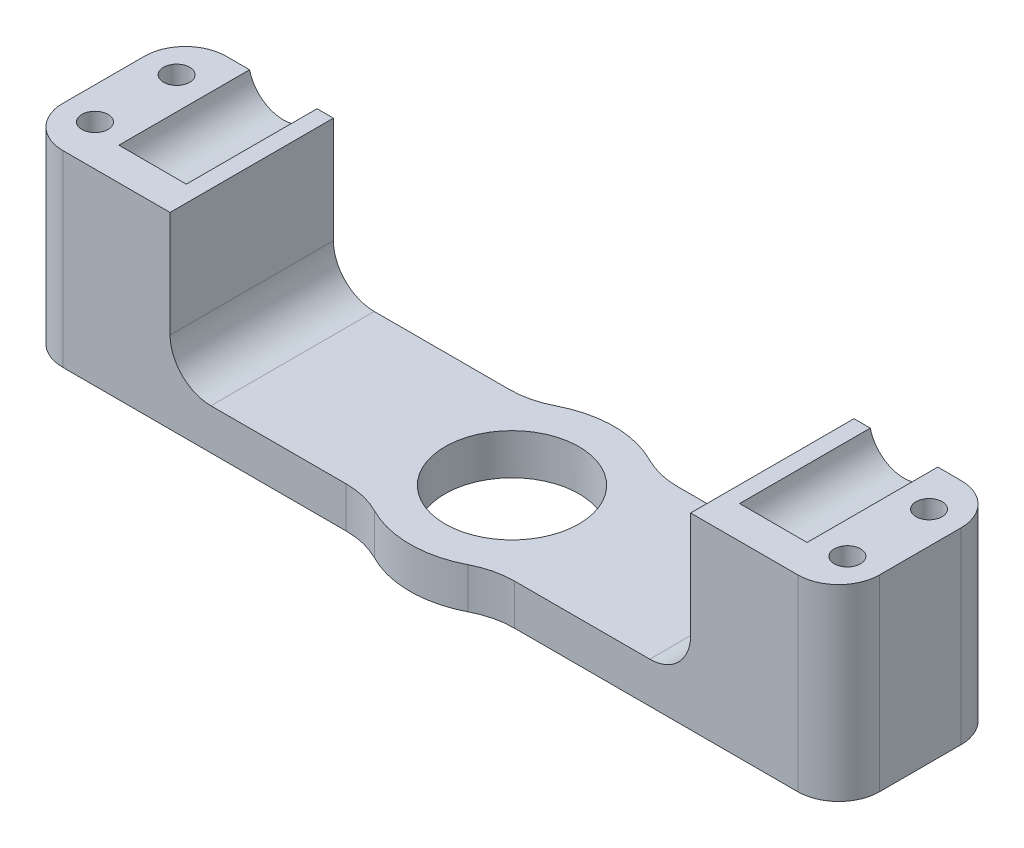
ISO-10303-21;
HEADER;
FILE_DESCRIPTION(('STEP AP214'),'2;1');
FILE_NAME('part.step','',(''),(''),'','','');
FILE_SCHEMA(('AUTOMOTIVE_DESIGN { 1 0 10303 214 1 1 1 1 }'));
ENDSEC;
DATA;
#1=APPLICATION_CONTEXT('core data for automotive mechanical design processes');
#2=APPLICATION_PROTOCOL_DEFINITION('international standard','automotive_design',2000,#1);
#3=PRODUCT_CONTEXT('',#1,'mechanical');
#4=PRODUCT('Part','Part','',(#3));
#5=PRODUCT_RELATED_PRODUCT_CATEGORY('part','',(#4));
#6=PRODUCT_DEFINITION_FORMATION('','',#4);
#7=PRODUCT_DEFINITION_CONTEXT('part definition',#1,'design');
#8=PRODUCT_DEFINITION('design','',#6,#7);
#9=PRODUCT_DEFINITION_SHAPE('','',#8);
#10=(LENGTH_UNIT() NAMED_UNIT(*) SI_UNIT(.MILLI.,.METRE.));
#11=(NAMED_UNIT(*) PLANE_ANGLE_UNIT() SI_UNIT($,.RADIAN.));
#12=(NAMED_UNIT(*) SI_UNIT($,.STERADIAN.) SOLID_ANGLE_UNIT());
#13=UNCERTAINTY_MEASURE_WITH_UNIT(LENGTH_MEASURE(1.E-05),#10,'distance_accuracy_value','');
#14=(GEOMETRIC_REPRESENTATION_CONTEXT(3) GLOBAL_UNCERTAINTY_ASSIGNED_CONTEXT((#13)) GLOBAL_UNIT_ASSIGNED_CONTEXT((#10,
#11,#12)) REPRESENTATION_CONTEXT('',''));
#15=CARTESIAN_POINT('',(0.,0.,0.));
#16=DIRECTION('',(0.,0.,1.));
#17=DIRECTION('',(1.,0.,0.));
#18=AXIS2_PLACEMENT_3D('',#15,#16,#17);
#19=CARTESIAN_POINT('',(-38.,24.,-10.));
#20=DIRECTION('',(0.,0.,1.));
#21=DIRECTION('',(1.,0.,0.));
#22=AXIS2_PLACEMENT_3D('',#19,#20,#21);
#23=CYLINDRICAL_SURFACE('',#22,4.25);
#24=CARTESIAN_POINT('',(-38.,24.,6.));
#25=DIRECTION('',(0.,0.,1.));
#26=DIRECTION('',(1.,0.,0.));
#27=AXIS2_PLACEMENT_3D('',#24,#25,#26);
#28=CIRCLE('',#27,4.25);
#29=CARTESIAN_POINT('',(-42.1306779104646,23.,6.));
#30=VERTEX_POINT('',#29);
#31=CARTESIAN_POINT('',(-33.8693220895354,23.,6.));
#32=VERTEX_POINT('',#31);
#33=EDGE_CURVE('E54',#30,#32,#28,.T.);
#34=ORIENTED_EDGE('',*,*,#33,.T.);
#35=DIRECTION('',(0.,0.,1.));
#36=VECTOR('',#35,1.);
#37=CARTESIAN_POINT('',(-33.8693220895354,23.,-10.));
#38=LINE('',#37,#36);
#39=CARTESIAN_POINT('',(-33.8693220895354,23.,-10.));
#40=VERTEX_POINT('',#39);
#41=EDGE_CURVE('E309',#32,#40,#38,.F.);
#42=ORIENTED_EDGE('',*,*,#41,.T.);
#43=CARTESIAN_POINT('',(-38.,24.,-10.));
#44=DIRECTION('',(0.,0.,1.));
#45=DIRECTION('',(1.,0.,0.));
#46=AXIS2_PLACEMENT_3D('',#43,#44,#45);
#47=CIRCLE('',#46,4.25);
#48=CARTESIAN_POINT('',(-42.1306779104646,23.,-10.));
#49=VERTEX_POINT('',#48);
#50=EDGE_CURVE('E328',#49,#40,#47,.T.);
#51=ORIENTED_EDGE('',*,*,#50,.F.);
#52=DIRECTION('',(0.,0.,1.));
#53=VECTOR('',#52,1.);
#54=CARTESIAN_POINT('',(-42.1306779104646,23.,-10.));
#55=LINE('',#54,#53);
#56=EDGE_CURVE('E59',#49,#30,#55,.T.);
#57=ORIENTED_EDGE('',*,*,#56,.T.);
#58=EDGE_LOOP('',(#34,#42,#51,#57));
#59=FACE_BOUND('',#58,.T.);
#60=ADVANCED_FACE('F39',(#59),#23,.F.);
#61=CARTESIAN_POINT('',(38.,24.,-10.));
#62=DIRECTION('',(0.,0.,1.));
#63=DIRECTION('',(1.,0.,0.));
#64=AXIS2_PLACEMENT_3D('',#61,#62,#63);
#65=CYLINDRICAL_SURFACE('',#64,4.25);
#66=CARTESIAN_POINT('',(38.,24.,6.));
#67=DIRECTION('',(0.,0.,1.));
#68=DIRECTION('',(1.,0.,0.));
#69=AXIS2_PLACEMENT_3D('',#66,#67,#68);
#70=CIRCLE('',#69,4.25);
#71=CARTESIAN_POINT('',(33.8693220895354,23.,6.));
#72=VERTEX_POINT('',#71);
#73=CARTESIAN_POINT('',(42.1306779104646,23.,6.));
#74=VERTEX_POINT('',#73);
#75=EDGE_CURVE('E224',#72,#74,#70,.T.);
#76=ORIENTED_EDGE('',*,*,#75,.T.);
#77=DIRECTION('',(0.,0.,1.));
#78=VECTOR('',#77,1.);
#79=CARTESIAN_POINT('',(42.1306779104646,23.,-10.));
#80=LINE('',#79,#78);
#81=CARTESIAN_POINT('',(42.1306779104646,23.,-10.));
#82=VERTEX_POINT('',#81);
#83=EDGE_CURVE('E210',#74,#82,#80,.F.);
#84=ORIENTED_EDGE('',*,*,#83,.T.);
#85=CARTESIAN_POINT('',(38.,24.,-10.));
#86=DIRECTION('',(0.,0.,1.));
#87=DIRECTION('',(-1.,0.,0.));
#88=AXIS2_PLACEMENT_3D('',#85,#86,#87);
#89=CIRCLE('',#88,4.25);
#90=CARTESIAN_POINT('',(33.8693220895354,23.,-10.));
#91=VERTEX_POINT('',#90);
#92=EDGE_CURVE('E332',#91,#82,#89,.T.);
#93=ORIENTED_EDGE('',*,*,#92,.F.);
#94=DIRECTION('',(0.,0.,1.));
#95=VECTOR('',#94,1.);
#96=CARTESIAN_POINT('',(33.8693220895354,23.,-10.));
#97=LINE('',#96,#95);
#98=EDGE_CURVE('E226',#91,#72,#97,.T.);
#99=ORIENTED_EDGE('',*,*,#98,.T.);
#100=EDGE_LOOP('',(#76,#84,#93,#99));
#101=FACE_BOUND('',#100,.T.);
#102=ADVANCED_FACE('F225',(#101),#65,.F.);
#103=CARTESIAN_POINT('',(-44.,48.,-10.));
#104=DIRECTION('',(0.,0.,1.));
#105=DIRECTION('',(1.,0.,0.));
#106=AXIS2_PLACEMENT_3D('',#103,#104,#105);
#107=PLANE('',#106);
#108=DIRECTION('',(1.,0.,0.));
#109=VECTOR('',#108,1.);
#110=CARTESIAN_POINT('',(-44.,23.,-10.));
#111=LINE('',#110,#109);
#112=CARTESIAN_POINT('',(45.,23.,-10.));
#113=VERTEX_POINT('',#112);
#114=EDGE_CURVE('E217',#82,#113,#111,.T.);
#115=ORIENTED_EDGE('',*,*,#114,.T.);
#116=DIRECTION('',(0.,1.,0.));
#117=VECTOR('',#116,1.);
#118=CARTESIAN_POINT('',(45.,0.,-10.));
#119=LINE('',#118,#117);
#120=CARTESIAN_POINT('',(45.,0.,-10.));
#121=VERTEX_POINT('',#120);
#122=EDGE_CURVE('E11',#113,#121,#119,.F.);
#123=ORIENTED_EDGE('',*,*,#122,.T.);
#124=DIRECTION('',(-1.,0.,0.));
#125=VECTOR('',#124,1.);
#126=CARTESIAN_POINT('',(-44.,0.,-10.));
#127=LINE('',#126,#125);
#128=CARTESIAN_POINT('',(10.3077640640441,0.,-10.));
#129=VERTEX_POINT('',#128);
#130=EDGE_CURVE('E334',#121,#129,#127,.T.);
#131=ORIENTED_EDGE('',*,*,#130,.T.);
#132=DIRECTION('',(0.,1.,0.));
#133=VECTOR('',#132,1.);
#134=CARTESIAN_POINT('',(10.3077640640441,48.,-10.));
#135=LINE('',#134,#133);
#136=CARTESIAN_POINT('',(10.3077640640441,5.,-10.));
#137=VERTEX_POINT('',#136);
#138=EDGE_CURVE('E349',#129,#137,#135,.T.);
#139=ORIENTED_EDGE('',*,*,#138,.T.);
#140=DIRECTION('',(1.,0.,0.));
#141=VECTOR('',#140,1.);
#142=CARTESIAN_POINT('',(-44.,4.99999999999999,-10.));
#143=LINE('',#142,#141);
#144=CARTESIAN_POINT('',(26.8693220895354,5.,-10.));
#145=VERTEX_POINT('',#144);
#146=EDGE_CURVE('E287',#137,#145,#143,.T.);
#147=ORIENTED_EDGE('',*,*,#146,.T.);
#148=CARTESIAN_POINT('',(26.8693220895354,10.,-10.));
#149=DIRECTION('',(0.,0.,1.));
#150=DIRECTION('',(1.,0.,0.));
#151=AXIS2_PLACEMENT_3D('',#148,#149,#150);
#152=CIRCLE('',#151,5.);
#153=CARTESIAN_POINT('',(31.8693220895354,9.99999999999999,-10.));
#154=VERTEX_POINT('',#153);
#155=EDGE_CURVE('E394',#145,#154,#152,.T.);
#156=ORIENTED_EDGE('',*,*,#155,.T.);
#157=DIRECTION('',(0.,1.,0.));
#158=VECTOR('',#157,1.);
#159=CARTESIAN_POINT('',(31.8693220895354,48.,-10.));
#160=LINE('',#159,#158);
#161=CARTESIAN_POINT('',(31.8693220895354,23.,-10.));
#162=VERTEX_POINT('',#161);
#163=EDGE_CURVE('E278',#154,#162,#160,.T.);
#164=ORIENTED_EDGE('',*,*,#163,.T.);
#165=EDGE_CURVE('E312',#162,#91,#111,.T.);
#166=ORIENTED_EDGE('',*,*,#165,.T.);
#167=ORIENTED_EDGE('',*,*,#92,.T.);
#168=EDGE_LOOP('',(#115,#123,#131,#139,#147,#156,#164,#166,#167));
#169=FACE_BOUND('',#168,.T.);
#170=ADVANCED_FACE('F510',(#169),#107,.F.);
#171=CARTESIAN_POINT('',(-44.,48.,10.));
#172=DIRECTION('',(0.,0.,-1.));
#173=DIRECTION('',(-1.,0.,0.));
#174=AXIS2_PLACEMENT_3D('',#171,#172,#173);
#175=PLANE('',#174);
#176=DIRECTION('',(-1.,0.,0.));
#177=VECTOR('',#176,1.);
#178=CARTESIAN_POINT('',(-44.,23.,10.));
#179=LINE('',#178,#177);
#180=CARTESIAN_POINT('',(-31.8693220895354,23.,10.));
#181=VERTEX_POINT('',#180);
#182=CARTESIAN_POINT('',(-45.,23.,10.));
#183=VERTEX_POINT('',#182);
#184=EDGE_CURVE('E221',#181,#183,#179,.T.);
#185=ORIENTED_EDGE('',*,*,#184,.T.);
#186=DIRECTION('',(0.,-1.,0.));
#187=VECTOR('',#186,1.);
#188=CARTESIAN_POINT('',(-45.,0.,10.));
#189=LINE('',#188,#187);
#190=CARTESIAN_POINT('',(-45.,0.,10.));
#191=VERTEX_POINT('',#190);
#192=EDGE_CURVE('E415',#183,#191,#189,.T.);
#193=ORIENTED_EDGE('',*,*,#192,.T.);
#194=DIRECTION('',(1.,0.,0.));
#195=VECTOR('',#194,1.);
#196=CARTESIAN_POINT('',(-44.,0.,10.));
#197=LINE('',#196,#195);
#198=CARTESIAN_POINT('',(-10.3077640640441,0.,10.));
#199=VERTEX_POINT('',#198);
#200=EDGE_CURVE('E337',#191,#199,#197,.T.);
#201=ORIENTED_EDGE('',*,*,#200,.T.);
#202=DIRECTION('',(0.,1.,0.));
#203=VECTOR('',#202,1.);
#204=CARTESIAN_POINT('',(-10.3077640640441,48.,10.));
#205=LINE('',#204,#203);
#206=CARTESIAN_POINT('',(-10.3077640640441,4.99999999999999,10.));
#207=VERTEX_POINT('',#206);
#208=EDGE_CURVE('E346',#199,#207,#205,.T.);
#209=ORIENTED_EDGE('',*,*,#208,.T.);
#210=DIRECTION('',(-1.,0.,0.));
#211=VECTOR('',#210,1.);
#212=CARTESIAN_POINT('',(-44.,4.99999999999999,10.));
#213=LINE('',#212,#211);
#214=CARTESIAN_POINT('',(-26.8693220895354,4.99999999999999,10.));
#215=VERTEX_POINT('',#214);
#216=EDGE_CURVE('E293',#207,#215,#213,.T.);
#217=ORIENTED_EDGE('',*,*,#216,.T.);
#218=CARTESIAN_POINT('',(-26.8693220895354,9.99999999999999,10.));
#219=DIRECTION('',(0.,0.,-1.));
#220=DIRECTION('',(-1.,0.,0.));
#221=AXIS2_PLACEMENT_3D('',#218,#219,#220);
#222=CIRCLE('',#221,5.);
#223=CARTESIAN_POINT('',(-31.8693220895354,9.99999999999999,10.));
#224=VERTEX_POINT('',#223);
#225=EDGE_CURVE('E388',#215,#224,#222,.T.);
#226=ORIENTED_EDGE('',*,*,#225,.T.);
#227=DIRECTION('',(0.,1.,0.));
#228=VECTOR('',#227,1.);
#229=CARTESIAN_POINT('',(-31.8693220895354,48.,10.));
#230=LINE('',#229,#228);
#231=EDGE_CURVE('E272',#224,#181,#230,.T.);
#232=ORIENTED_EDGE('',*,*,#231,.T.);
#233=EDGE_LOOP('',(#185,#193,#201,#209,#217,#226,#232));
#234=FACE_BOUND('',#233,.T.);
#235=ADVANCED_FACE('F464',(#234),#175,.F.);
#236=CARTESIAN_POINT('',(-10.3077640640441,0.,-10.));
#237=VERTEX_POINT('',#236);
#238=CARTESIAN_POINT('',(-45.,0.,-10.));
#239=VERTEX_POINT('',#238);
#240=EDGE_CURVE('E331',#237,#239,#127,.T.);
#241=ORIENTED_EDGE('',*,*,#240,.T.);
#242=DIRECTION('',(0.,1.,0.));
#243=VECTOR('',#242,1.);
#244=CARTESIAN_POINT('',(-45.,23.,-10.));
#245=LINE('',#244,#243);
#246=CARTESIAN_POINT('',(-45.,23.,-10.));
#247=VERTEX_POINT('',#246);
#248=EDGE_CURVE('E396',#239,#247,#245,.T.);
#249=ORIENTED_EDGE('',*,*,#248,.T.);
#250=DIRECTION('',(1.,0.,0.));
#251=VECTOR('',#250,1.);
#252=CARTESIAN_POINT('',(-44.,23.,-10.));
#253=LINE('',#252,#251);
#254=EDGE_CURVE('E310',#247,#49,#253,.T.);
#255=ORIENTED_EDGE('',*,*,#254,.T.);
#256=ORIENTED_EDGE('',*,*,#50,.T.);
#257=CARTESIAN_POINT('',(-31.8693220895354,23.,-10.));
#258=VERTEX_POINT('',#257);
#259=EDGE_CURVE('E306',#40,#258,#253,.T.);
#260=ORIENTED_EDGE('',*,*,#259,.T.);
#261=DIRECTION('',(0.,-1.,0.));
#262=VECTOR('',#261,1.);
#263=CARTESIAN_POINT('',(-31.8693220895354,48.,-10.));
#264=LINE('',#263,#262);
#265=CARTESIAN_POINT('',(-31.8693220895354,9.99999999999999,-10.));
#266=VERTEX_POINT('',#265);
#267=EDGE_CURVE('E269',#258,#266,#264,.T.);
#268=ORIENTED_EDGE('',*,*,#267,.T.);
#269=CARTESIAN_POINT('',(-26.8693220895354,9.99999999999999,-10.));
#270=DIRECTION('',(0.,0.,1.));
#271=DIRECTION('',(1.,0.,0.));
#272=AXIS2_PLACEMENT_3D('',#269,#270,#271);
#273=CIRCLE('',#272,5.);
#274=CARTESIAN_POINT('',(-26.8693220895354,4.99999999999999,-10.));
#275=VERTEX_POINT('',#274);
#276=EDGE_CURVE('E390',#266,#275,#273,.T.);
#277=ORIENTED_EDGE('',*,*,#276,.T.);
#278=DIRECTION('',(1.,0.,0.));
#279=VECTOR('',#278,1.);
#280=CARTESIAN_POINT('',(-44.,4.99999999999999,-10.));
#281=LINE('',#280,#279);
#282=CARTESIAN_POINT('',(-10.3077640640441,4.99999999999999,-10.));
#283=VERTEX_POINT('',#282);
#284=EDGE_CURVE('E280',#275,#283,#281,.T.);
#285=ORIENTED_EDGE('',*,*,#284,.T.);
#286=DIRECTION('',(0.,1.,0.));
#287=VECTOR('',#286,1.);
#288=CARTESIAN_POINT('',(-10.3077640640441,48.,-10.));
#289=LINE('',#288,#287);
#290=EDGE_CURVE('E357',#283,#237,#289,.F.);
#291=ORIENTED_EDGE('',*,*,#290,.T.);
#292=EDGE_LOOP('',(#241,#249,#255,#256,#260,#268,#277,#285,#291));
#293=FACE_BOUND('',#292,.T.);
#294=ADVANCED_FACE('F483',(#293),#107,.F.);
#295=CARTESIAN_POINT('',(10.3077640640441,0.,10.));
#296=VERTEX_POINT('',#295);
#297=CARTESIAN_POINT('',(45.,0.,10.));
#298=VERTEX_POINT('',#297);
#299=EDGE_CURVE('E336',#296,#298,#197,.T.);
#300=ORIENTED_EDGE('',*,*,#299,.T.);
#301=DIRECTION('',(0.,-1.,0.));
#302=VECTOR('',#301,1.);
#303=CARTESIAN_POINT('',(45.,23.,10.));
#304=LINE('',#303,#302);
#305=CARTESIAN_POINT('',(45.,23.,10.));
#306=VERTEX_POINT('',#305);
#307=EDGE_CURVE('E424',#298,#306,#304,.F.);
#308=ORIENTED_EDGE('',*,*,#307,.T.);
#309=DIRECTION('',(-1.,0.,0.));
#310=VECTOR('',#309,1.);
#311=CARTESIAN_POINT('',(-44.,23.,10.));
#312=LINE('',#311,#310);
#313=CARTESIAN_POINT('',(31.8693220895354,23.,10.));
#314=VERTEX_POINT('',#313);
#315=EDGE_CURVE('E317',#306,#314,#312,.T.);
#316=ORIENTED_EDGE('',*,*,#315,.T.);
#317=DIRECTION('',(0.,-1.,0.));
#318=VECTOR('',#317,1.);
#319=CARTESIAN_POINT('',(31.8693220895354,48.,10.));
#320=LINE('',#319,#318);
#321=CARTESIAN_POINT('',(31.8693220895354,9.99999999999999,10.));
#322=VERTEX_POINT('',#321);
#323=EDGE_CURVE('E275',#314,#322,#320,.T.);
#324=ORIENTED_EDGE('',*,*,#323,.T.);
#325=CARTESIAN_POINT('',(26.8693220895354,10.,10.));
#326=DIRECTION('',(0.,0.,-1.));
#327=DIRECTION('',(-1.,0.,0.));
#328=AXIS2_PLACEMENT_3D('',#325,#326,#327);
#329=CIRCLE('',#328,5.);
#330=CARTESIAN_POINT('',(26.8693220895354,5.,10.));
#331=VERTEX_POINT('',#330);
#332=EDGE_CURVE('E392',#322,#331,#329,.T.);
#333=ORIENTED_EDGE('',*,*,#332,.T.);
#334=DIRECTION('',(-1.,0.,0.));
#335=VECTOR('',#334,1.);
#336=CARTESIAN_POINT('',(-44.,4.99999999999999,10.));
#337=LINE('',#336,#335);
#338=CARTESIAN_POINT('',(10.3077640640441,5.,10.));
#339=VERTEX_POINT('',#338);
#340=EDGE_CURVE('E301',#331,#339,#337,.T.);
#341=ORIENTED_EDGE('',*,*,#340,.T.);
#342=DIRECTION('',(0.,1.,0.));
#343=VECTOR('',#342,1.);
#344=CARTESIAN_POINT('',(10.3077640640441,48.,10.));
#345=LINE('',#344,#343);
#346=EDGE_CURVE('E339',#339,#296,#345,.F.);
#347=ORIENTED_EDGE('',*,*,#346,.T.);
#348=EDGE_LOOP('',(#300,#308,#316,#324,#333,#341,#347));
#349=FACE_BOUND('',#348,.T.);
#350=ADVANCED_FACE('F443',(#349),#175,.F.);
#351=CARTESIAN_POINT('',(0.,0.,0.));
#352=DIRECTION('',(0.,-1.,0.));
#353=DIRECTION('',(0.,0.,-1.));
#354=AXIS2_PLACEMENT_3D('',#351,#352,#353);
#355=PLANE('',#354);
#356=CARTESIAN_POINT('',(-46.0653389552323,0.,-5.));
#357=DIRECTION('',(0.,-1.,0.));
#358=DIRECTION('',(0.,0.,1.));
#359=AXIS2_PLACEMENT_3D('',#356,#357,#358);
#360=CIRCLE('',#359,1.6);
#361=CARTESIAN_POINT('',(-46.0653389552323,0.,-3.4));
#362=VERTEX_POINT('',#361);
#363=EDGE_CURVE('E237',#362,#362,#360,.T.);
#364=ORIENTED_EDGE('',*,*,#363,.F.);
#365=EDGE_LOOP('',(#364));
#366=FACE_BOUND('',#365,.T.);
#367=CARTESIAN_POINT('',(-46.0653389552323,0.,5.));
#368=DIRECTION('',(0.,-1.,0.));
#369=DIRECTION('',(0.,0.,1.));
#370=AXIS2_PLACEMENT_3D('',#367,#368,#369);
#371=CIRCLE('',#370,1.6);
#372=CARTESIAN_POINT('',(-46.0653389552323,0.,6.6));
#373=VERTEX_POINT('',#372);
#374=EDGE_CURVE('E233',#373,#373,#371,.T.);
#375=ORIENTED_EDGE('',*,*,#374,.F.);
#376=EDGE_LOOP('',(#375));
#377=FACE_BOUND('',#376,.T.);
#378=CARTESIAN_POINT('',(46.0653389552323,0.,-5.));
#379=DIRECTION('',(0.,1.,0.));
#380=DIRECTION('',(0.,0.,1.));
#381=AXIS2_PLACEMENT_3D('',#378,#379,#380);
#382=CIRCLE('',#381,1.6);
#383=CARTESIAN_POINT('',(46.0653389552323,0.,-3.4));
#384=VERTEX_POINT('',#383);
#385=EDGE_CURVE('E252',#384,#384,#382,.T.);
#386=ORIENTED_EDGE('',*,*,#385,.T.);
#387=EDGE_LOOP('',(#386));
#388=FACE_BOUND('',#387,.T.);
#389=CARTESIAN_POINT('',(46.0653389552323,0.,5.));
#390=DIRECTION('',(0.,1.,0.));
#391=DIRECTION('',(0.,0.,1.));
#392=AXIS2_PLACEMENT_3D('',#389,#390,#391);
#393=CIRCLE('',#392,1.6);
#394=CARTESIAN_POINT('',(46.0653389552323,0.,6.6));
#395=VERTEX_POINT('',#394);
#396=EDGE_CURVE('E251',#395,#395,#393,.T.);
#397=ORIENTED_EDGE('',*,*,#396,.T.);
#398=EDGE_LOOP('',(#397));
#399=FACE_BOUND('',#398,.T.);
#400=CARTESIAN_POINT('',(0.,0.,0.));
#401=DIRECTION('',(0.,1.,0.));
#402=DIRECTION('',(0.,0.,1.));
#403=AXIS2_PLACEMENT_3D('',#400,#401,#402);
#404=CIRCLE('',#403,8.2);
#405=CARTESIAN_POINT('',(0.,0.,8.2));
#406=VERTEX_POINT('',#405);
#407=EDGE_CURVE('E321',#406,#406,#404,.T.);
#408=ORIENTED_EDGE('',*,*,#407,.T.);
#409=EDGE_LOOP('',(#408));
#410=FACE_BOUND('',#409,.T.);
#411=DIRECTION('',(0.,0.,-1.));
#412=VECTOR('',#411,1.);
#413=CARTESIAN_POINT('',(-50.,0.,10.));
#414=LINE('',#413,#412);
#415=CARTESIAN_POINT('',(-50.,0.,5.));
#416=VERTEX_POINT('',#415);
#417=CARTESIAN_POINT('',(-50.,0.,-5.));
#418=VERTEX_POINT('',#417);
#419=EDGE_CURVE('E240',#416,#418,#414,.T.);
#420=ORIENTED_EDGE('',*,*,#419,.T.);
#421=CARTESIAN_POINT('',(-45.,0.,-5.));
#422=DIRECTION('',(0.,-1.,0.));
#423=DIRECTION('',(0.,0.,-1.));
#424=AXIS2_PLACEMENT_3D('',#421,#422,#423);
#425=CIRCLE('',#424,5.);
#426=EDGE_CURVE('E413',#418,#239,#425,.T.);
#427=ORIENTED_EDGE('',*,*,#426,.T.);
#428=ORIENTED_EDGE('',*,*,#240,.F.);
#429=CARTESIAN_POINT('',(-10.3077640640441,0.,-20.));
#430=DIRECTION('',(0.,-1.,0.));
#431=DIRECTION('',(0.,0.,-1.));
#432=AXIS2_PLACEMENT_3D('',#429,#430,#431);
#433=CIRCLE('',#432,10.);
#434=CARTESIAN_POINT('',(-5.72653559113563,0.,-11.1111111111111));
#435=VERTEX_POINT('',#434);
#436=EDGE_CURVE('E367',#237,#435,#433,.F.);
#437=ORIENTED_EDGE('',*,*,#436,.T.);
#438=CARTESIAN_POINT('',(0.,0.,0.));
#439=DIRECTION('',(0.,-1.,0.));
#440=DIRECTION('',(0.,0.,-1.));
#441=AXIS2_PLACEMENT_3D('',#438,#439,#440);
#442=CIRCLE('',#441,12.5);
#443=CARTESIAN_POINT('',(5.72653559113563,0.,-11.1111111111111));
#444=VERTEX_POINT('',#443);
#445=EDGE_CURVE('E324',#444,#435,#442,.F.);
#446=ORIENTED_EDGE('',*,*,#445,.F.);
#447=CARTESIAN_POINT('',(10.3077640640441,0.,-20.));
#448=DIRECTION('',(0.,-1.,0.));
#449=DIRECTION('',(0.,0.,-1.));
#450=AXIS2_PLACEMENT_3D('',#447,#448,#449);
#451=CIRCLE('',#450,10.);
#452=EDGE_CURVE('E364',#444,#129,#451,.F.);
#453=ORIENTED_EDGE('',*,*,#452,.T.);
#454=ORIENTED_EDGE('',*,*,#130,.F.);
#455=CARTESIAN_POINT('',(45.,0.,-5.));
#456=DIRECTION('',(0.,-1.,0.));
#457=DIRECTION('',(0.,0.,-1.));
#458=AXIS2_PLACEMENT_3D('',#455,#456,#457);
#459=CIRCLE('',#458,5.);
#460=CARTESIAN_POINT('',(50.,0.,-5.));
#461=VERTEX_POINT('',#460);
#462=EDGE_CURVE('E407',#121,#461,#459,.T.);
#463=ORIENTED_EDGE('',*,*,#462,.T.);
#464=DIRECTION('',(0.,0.,-1.));
#465=VECTOR('',#464,1.);
#466=CARTESIAN_POINT('',(50.,0.,10.));
#467=LINE('',#466,#465);
#468=CARTESIAN_POINT('',(50.,0.,5.));
#469=VERTEX_POINT('',#468);
#470=EDGE_CURVE('E255',#469,#461,#467,.T.);
#471=ORIENTED_EDGE('',*,*,#470,.F.);
#472=CARTESIAN_POINT('',(45.,0.,5.));
#473=DIRECTION('',(0.,-1.,0.));
#474=DIRECTION('',(0.,0.,-1.));
#475=AXIS2_PLACEMENT_3D('',#472,#473,#474);
#476=CIRCLE('',#475,5.);
#477=EDGE_CURVE('E409',#469,#298,#476,.T.);
#478=ORIENTED_EDGE('',*,*,#477,.T.);
#479=ORIENTED_EDGE('',*,*,#299,.F.);
#480=CARTESIAN_POINT('',(10.3077640640441,0.,20.));
#481=DIRECTION('',(0.,-1.,0.));
#482=DIRECTION('',(0.,0.,-1.));
#483=AXIS2_PLACEMENT_3D('',#480,#481,#482);
#484=CIRCLE('',#483,10.);
#485=CARTESIAN_POINT('',(5.72653559113563,0.,11.1111111111111));
#486=VERTEX_POINT('',#485);
#487=EDGE_CURVE('E359',#296,#486,#484,.F.);
#488=ORIENTED_EDGE('',*,*,#487,.T.);
#489=CARTESIAN_POINT('',(-5.72653559113563,0.,11.1111111111111));
#490=VERTEX_POINT('',#489);
#491=EDGE_CURVE('E327',#490,#486,#442,.F.);
#492=ORIENTED_EDGE('',*,*,#491,.F.);
#493=CARTESIAN_POINT('',(-10.3077640640441,0.,20.));
#494=DIRECTION('',(0.,-1.,0.));
#495=DIRECTION('',(0.,0.,-1.));
#496=AXIS2_PLACEMENT_3D('',#493,#494,#495);
#497=CIRCLE('',#496,10.);
#498=EDGE_CURVE('E361',#490,#199,#497,.F.);
#499=ORIENTED_EDGE('',*,*,#498,.T.);
#500=ORIENTED_EDGE('',*,*,#200,.F.);
#501=CARTESIAN_POINT('',(-45.,0.,5.));
#502=DIRECTION('',(0.,-1.,0.));
#503=DIRECTION('',(0.,0.,-1.));
#504=AXIS2_PLACEMENT_3D('',#501,#502,#503);
#505=CIRCLE('',#504,5.);
#506=EDGE_CURVE('E411',#191,#416,#505,.T.);
#507=ORIENTED_EDGE('',*,*,#506,.T.);
#508=EDGE_LOOP('',(#420,#427,#428,#437,#446,#453,#454,#463,#471,#478,#479,#488,#492,#499,#500,#507));
#509=FACE_BOUND('',#508,.T.);
#510=ADVANCED_FACE('F441',(#366,#377,#388,#399,#410,#509),#355,.T.);
#511=CARTESIAN_POINT('',(0.,-35.3553390593274,0.));
#512=DIRECTION('',(0.,1.,0.));
#513=DIRECTION('',(0.,0.,1.));
#514=AXIS2_PLACEMENT_3D('',#511,#512,#513);
#515=CYLINDRICAL_SURFACE('',#514,12.5);
#516=CARTESIAN_POINT('',(0.,5.,0.));
#517=DIRECTION('',(0.,-1.,0.));
#518=DIRECTION('',(1.,0.,0.));
#519=AXIS2_PLACEMENT_3D('',#516,#517,#518);
#520=CIRCLE('',#519,12.5);
#521=CARTESIAN_POINT('',(-5.72653559113563,4.99999999999999,11.1111111111111));
#522=VERTEX_POINT('',#521);
#523=CARTESIAN_POINT('',(5.72653559113563,5.,11.1111111111111));
#524=VERTEX_POINT('',#523);
#525=EDGE_CURVE('E294',#522,#524,#520,.F.);
#526=ORIENTED_EDGE('',*,*,#525,.F.);
#527=DIRECTION('',(0.,1.,0.));
#528=VECTOR('',#527,1.);
#529=CARTESIAN_POINT('',(-5.72653559113563,-35.3553390593274,11.1111111111111));
#530=LINE('',#529,#528);
#531=EDGE_CURVE('E341',#522,#490,#530,.F.);
#532=ORIENTED_EDGE('',*,*,#531,.T.);
#533=ORIENTED_EDGE('',*,*,#491,.T.);
#534=DIRECTION('',(0.,1.,0.));
#535=VECTOR('',#534,1.);
#536=CARTESIAN_POINT('',(5.72653559113563,-35.3553390593274,11.1111111111111));
#537=LINE('',#536,#535);
#538=EDGE_CURVE('E343',#486,#524,#537,.T.);
#539=ORIENTED_EDGE('',*,*,#538,.T.);
#540=EDGE_LOOP('',(#526,#532,#533,#539));
#541=FACE_BOUND('',#540,.T.);
#542=ADVANCED_FACE('F455',(#541),#515,.T.);
#543=DIRECTION('',(0.,1.,0.));
#544=VECTOR('',#543,1.);
#545=CARTESIAN_POINT('',(-5.72653559113563,-35.3553390593274,-11.1111111111111));
#546=LINE('',#545,#544);
#547=CARTESIAN_POINT('',(-5.72653559113563,4.99999999999999,-11.1111111111111));
#548=VERTEX_POINT('',#547);
#549=EDGE_CURVE('E352',#435,#548,#546,.T.);
#550=ORIENTED_EDGE('',*,*,#549,.T.);
#551=CARTESIAN_POINT('',(0.,5.,0.));
#552=DIRECTION('',(0.,-1.,0.));
#553=DIRECTION('',(1.,0.,0.));
#554=AXIS2_PLACEMENT_3D('',#551,#552,#553);
#555=CIRCLE('',#554,12.5);
#556=CARTESIAN_POINT('',(5.72653559113563,5.,-11.1111111111111));
#557=VERTEX_POINT('',#556);
#558=EDGE_CURVE('E281',#557,#548,#555,.F.);
#559=ORIENTED_EDGE('',*,*,#558,.F.);
#560=DIRECTION('',(0.,1.,0.));
#561=VECTOR('',#560,1.);
#562=CARTESIAN_POINT('',(5.72653559113563,-35.3553390593274,-11.1111111111111));
#563=LINE('',#562,#561);
#564=EDGE_CURVE('E355',#557,#444,#563,.F.);
#565=ORIENTED_EDGE('',*,*,#564,.T.);
#566=ORIENTED_EDGE('',*,*,#445,.T.);
#567=EDGE_LOOP('',(#550,#559,#565,#566));
#568=FACE_BOUND('',#567,.T.);
#569=ADVANCED_FACE('F492',(#568),#515,.T.);
#570=CARTESIAN_POINT('',(0.,0.,0.));
#571=DIRECTION('',(0.,1.,0.));
#572=DIRECTION('',(0.,0.,1.));
#573=AXIS2_PLACEMENT_3D('',#570,#571,#572);
#574=CYLINDRICAL_SURFACE('',#573,8.2);
#575=CARTESIAN_POINT('',(0.,5.,0.));
#576=DIRECTION('',(0.,-1.,0.));
#577=DIRECTION('',(1.,0.,0.));
#578=AXIS2_PLACEMENT_3D('',#575,#576,#577);
#579=CIRCLE('',#578,8.2);
#580=CARTESIAN_POINT('',(8.2,5.,0.));
#581=VERTEX_POINT('',#580);
#582=EDGE_CURVE('E303',#581,#581,#579,.F.);
#583=ORIENTED_EDGE('',*,*,#582,.T.);
#584=EDGE_LOOP('',(#583));
#585=FACE_BOUND('',#584,.T.);
#586=ORIENTED_EDGE('',*,*,#407,.F.);
#587=EDGE_LOOP('',(#586));
#588=FACE_BOUND('',#587,.T.);
#589=ADVANCED_FACE('F550',(#585,#588),#574,.F.);
#590=CARTESIAN_POINT('',(10.3077640640441,-35.3553390593274,20.));
#591=DIRECTION('',(0.,1.,0.));
#592=DIRECTION('',(0.,0.,1.));
#593=AXIS2_PLACEMENT_3D('',#590,#591,#592);
#594=CYLINDRICAL_SURFACE('',#593,10.);
#595=ORIENTED_EDGE('',*,*,#346,.F.);
#596=CARTESIAN_POINT('',(10.3077640640441,5.,20.));
#597=DIRECTION('',(0.,-1.,0.));
#598=DIRECTION('',(1.,0.,0.));
#599=AXIS2_PLACEMENT_3D('',#596,#597,#598);
#600=CIRCLE('',#599,10.);
#601=EDGE_CURVE('E296',#339,#524,#600,.F.);
#602=ORIENTED_EDGE('',*,*,#601,.T.);
#603=ORIENTED_EDGE('',*,*,#538,.F.);
#604=ORIENTED_EDGE('',*,*,#487,.F.);
#605=EDGE_LOOP('',(#595,#602,#603,#604));
#606=FACE_BOUND('',#605,.T.);
#607=ADVANCED_FACE('F450',(#606),#594,.F.);
#608=CARTESIAN_POINT('',(-10.3077640640441,-35.3553390593274,20.));
#609=DIRECTION('',(0.,1.,0.));
#610=DIRECTION('',(0.,0.,1.));
#611=AXIS2_PLACEMENT_3D('',#608,#609,#610);
#612=CYLINDRICAL_SURFACE('',#611,10.);
#613=ORIENTED_EDGE('',*,*,#531,.F.);
#614=CARTESIAN_POINT('',(-10.3077640640441,4.99999999999999,20.));
#615=DIRECTION('',(0.,-1.,0.));
#616=DIRECTION('',(1.,0.,0.));
#617=AXIS2_PLACEMENT_3D('',#614,#615,#616);
#618=CIRCLE('',#617,10.);
#619=EDGE_CURVE('E290',#522,#207,#618,.F.);
#620=ORIENTED_EDGE('',*,*,#619,.T.);
#621=ORIENTED_EDGE('',*,*,#208,.F.);
#622=ORIENTED_EDGE('',*,*,#498,.F.);
#623=EDGE_LOOP('',(#613,#620,#621,#622));
#624=FACE_BOUND('',#623,.T.);
#625=ADVANCED_FACE('F459',(#624),#612,.F.);
#626=CARTESIAN_POINT('',(10.3077640640441,-35.3553390593274,-20.));
#627=DIRECTION('',(0.,1.,0.));
#628=DIRECTION('',(0.,0.,1.));
#629=AXIS2_PLACEMENT_3D('',#626,#627,#628);
#630=CYLINDRICAL_SURFACE('',#629,10.);
#631=ORIENTED_EDGE('',*,*,#564,.F.);
#632=CARTESIAN_POINT('',(10.3077640640441,5.,-20.));
#633=DIRECTION('',(0.,-1.,0.));
#634=DIRECTION('',(1.,0.,0.));
#635=AXIS2_PLACEMENT_3D('',#632,#633,#634);
#636=CIRCLE('',#635,10.);
#637=EDGE_CURVE('E283',#557,#137,#636,.F.);
#638=ORIENTED_EDGE('',*,*,#637,.T.);
#639=ORIENTED_EDGE('',*,*,#138,.F.);
#640=ORIENTED_EDGE('',*,*,#452,.F.);
#641=EDGE_LOOP('',(#631,#638,#639,#640));
#642=FACE_BOUND('',#641,.T.);
#643=ADVANCED_FACE('F503',(#642),#630,.F.);
#644=CARTESIAN_POINT('',(-10.3077640640441,-35.3553390593274,-20.));
#645=DIRECTION('',(0.,1.,0.));
#646=DIRECTION('',(0.,0.,1.));
#647=AXIS2_PLACEMENT_3D('',#644,#645,#646);
#648=CYLINDRICAL_SURFACE('',#647,10.);
#649=ORIENTED_EDGE('',*,*,#290,.F.);
#650=CARTESIAN_POINT('',(-10.3077640640441,4.99999999999999,-20.));
#651=DIRECTION('',(0.,-1.,0.));
#652=DIRECTION('',(1.,0.,0.));
#653=AXIS2_PLACEMENT_3D('',#650,#651,#652);
#654=CIRCLE('',#653,10.);
#655=EDGE_CURVE('E375',#283,#548,#654,.F.);
#656=ORIENTED_EDGE('',*,*,#655,.T.);
#657=ORIENTED_EDGE('',*,*,#549,.F.);
#658=ORIENTED_EDGE('',*,*,#436,.F.);
#659=EDGE_LOOP('',(#649,#656,#657,#658));
#660=FACE_BOUND('',#659,.T.);
#661=ADVANCED_FACE('F495',(#660),#648,.F.);
#662=CARTESIAN_POINT('',(44.,23.,-13.5));
#663=DIRECTION('',(0.,-1.,0.));
#664=DIRECTION('',(0.,0.,-1.));
#665=AXIS2_PLACEMENT_3D('',#662,#663,#664);
#666=PLANE('',#665);
#667=CARTESIAN_POINT('',(-46.0653389552323,23.,-5.));
#668=DIRECTION('',(0.,-1.,0.));
#669=DIRECTION('',(0.,0.,1.));
#670=AXIS2_PLACEMENT_3D('',#667,#668,#669);
#671=CIRCLE('',#670,1.6);
#672=CARTESIAN_POINT('',(-46.0653389552323,23.,-3.4));
#673=VERTEX_POINT('',#672);
#674=EDGE_CURVE('E241',#673,#673,#671,.T.);
#675=ORIENTED_EDGE('',*,*,#674,.T.);
#676=EDGE_LOOP('',(#675));
#677=FACE_BOUND('',#676,.T.);
#678=CARTESIAN_POINT('',(-46.0653389552323,23.,5.));
#679=DIRECTION('',(0.,-1.,0.));
#680=DIRECTION('',(0.,0.,1.));
#681=AXIS2_PLACEMENT_3D('',#678,#679,#680);
#682=CIRCLE('',#681,1.6);
#683=CARTESIAN_POINT('',(-46.0653389552323,23.,6.6));
#684=VERTEX_POINT('',#683);
#685=EDGE_CURVE('E230',#684,#684,#682,.T.);
#686=ORIENTED_EDGE('',*,*,#685,.T.);
#687=EDGE_LOOP('',(#686));
#688=FACE_BOUND('',#687,.T.);
#689=ORIENTED_EDGE('',*,*,#254,.F.);
#690=CARTESIAN_POINT('',(-45.,23.,-5.));
#691=DIRECTION('',(0.,-1.,0.));
#692=DIRECTION('',(0.,0.,-1.));
#693=AXIS2_PLACEMENT_3D('',#690,#691,#692);
#694=CIRCLE('',#693,5.);
#695=CARTESIAN_POINT('',(-50.,23.,-5.));
#696=VERTEX_POINT('',#695);
#697=EDGE_CURVE('E401',#247,#696,#694,.F.);
#698=ORIENTED_EDGE('',*,*,#697,.T.);
#699=DIRECTION('',(0.,0.,1.));
#700=VECTOR('',#699,1.);
#701=CARTESIAN_POINT('',(-50.,23.,-10.));
#702=LINE('',#701,#700);
#703=CARTESIAN_POINT('',(-50.,23.,5.));
#704=VERTEX_POINT('',#703);
#705=EDGE_CURVE('E248',#696,#704,#702,.T.);
#706=ORIENTED_EDGE('',*,*,#705,.T.);
#707=CARTESIAN_POINT('',(-45.,23.,5.));
#708=DIRECTION('',(0.,-1.,0.));
#709=DIRECTION('',(0.,0.,-1.));
#710=AXIS2_PLACEMENT_3D('',#707,#708,#709);
#711=CIRCLE('',#710,5.);
#712=EDGE_CURVE('E399',#704,#183,#711,.F.);
#713=ORIENTED_EDGE('',*,*,#712,.T.);
#714=ORIENTED_EDGE('',*,*,#184,.F.);
#715=DIRECTION('',(0.,0.,-1.));
#716=VECTOR('',#715,1.);
#717=CARTESIAN_POINT('',(-31.8693220895354,23.,-13.5));
#718=LINE('',#717,#716);
#719=EDGE_CURVE('E369',#181,#258,#718,.T.);
#720=ORIENTED_EDGE('',*,*,#719,.T.);
#721=ORIENTED_EDGE('',*,*,#259,.F.);
#722=ORIENTED_EDGE('',*,*,#41,.F.);
#723=DIRECTION('',(-1.,0.,0.));
#724=VECTOR('',#723,1.);
#725=CARTESIAN_POINT('',(-42.1306779104646,23.,6.));
#726=LINE('',#725,#724);
#727=EDGE_CURVE('E937',#32,#30,#726,.T.);
#728=ORIENTED_EDGE('',*,*,#727,.T.);
#729=ORIENTED_EDGE('',*,*,#56,.F.);
#730=EDGE_LOOP('',(#689,#698,#706,#713,#714,#720,#721,#722,#728,#729));
#731=FACE_BOUND('',#730,.T.);
#732=ADVANCED_FACE('F476',(#677,#688,#731),#666,.F.);
#733=CARTESIAN_POINT('',(46.0653389552323,23.,-5.));
#734=DIRECTION('',(0.,1.,0.));
#735=DIRECTION('',(0.,0.,1.));
#736=AXIS2_PLACEMENT_3D('',#733,#734,#735);
#737=CIRCLE('',#736,1.6);
#738=CARTESIAN_POINT('',(46.0653389552323,23.,-3.4));
#739=VERTEX_POINT('',#738);
#740=EDGE_CURVE('E256',#739,#739,#737,.T.);
#741=ORIENTED_EDGE('',*,*,#740,.F.);
#742=EDGE_LOOP('',(#741));
#743=FACE_BOUND('',#742,.T.);
#744=CARTESIAN_POINT('',(46.0653389552323,23.,5.));
#745=DIRECTION('',(0.,1.,0.));
#746=DIRECTION('',(0.,0.,1.));
#747=AXIS2_PLACEMENT_3D('',#744,#745,#746);
#748=CIRCLE('',#747,1.6);
#749=CARTESIAN_POINT('',(46.0653389552323,23.,6.6));
#750=VERTEX_POINT('',#749);
#751=EDGE_CURVE('E259',#750,#750,#748,.T.);
#752=ORIENTED_EDGE('',*,*,#751,.F.);
#753=EDGE_LOOP('',(#752));
#754=FACE_BOUND('',#753,.T.);
#755=ORIENTED_EDGE('',*,*,#315,.F.);
#756=CARTESIAN_POINT('',(45.,23.,5.));
#757=DIRECTION('',(0.,-1.,0.));
#758=DIRECTION('',(0.,0.,-1.));
#759=AXIS2_PLACEMENT_3D('',#756,#757,#758);
#760=CIRCLE('',#759,5.);
#761=CARTESIAN_POINT('',(50.,23.,5.));
#762=VERTEX_POINT('',#761);
#763=EDGE_CURVE('E47',#306,#762,#760,.F.);
#764=ORIENTED_EDGE('',*,*,#763,.T.);
#765=DIRECTION('',(0.,0.,1.));
#766=VECTOR('',#765,1.);
#767=CARTESIAN_POINT('',(50.,23.,-10.));
#768=LINE('',#767,#766);
#769=CARTESIAN_POINT('',(50.,23.,-5.));
#770=VERTEX_POINT('',#769);
#771=EDGE_CURVE('E266',#770,#762,#768,.T.);
#772=ORIENTED_EDGE('',*,*,#771,.F.);
#773=CARTESIAN_POINT('',(45.,23.,-5.));
#774=DIRECTION('',(0.,-1.,0.));
#775=DIRECTION('',(0.,0.,-1.));
#776=AXIS2_PLACEMENT_3D('',#773,#774,#775);
#777=CIRCLE('',#776,5.);
#778=EDGE_CURVE('E427',#770,#113,#777,.F.);
#779=ORIENTED_EDGE('',*,*,#778,.T.);
#780=ORIENTED_EDGE('',*,*,#114,.F.);
#781=ORIENTED_EDGE('',*,*,#83,.F.);
#782=DIRECTION('',(-1.,0.,0.));
#783=VECTOR('',#782,1.);
#784=CARTESIAN_POINT('',(33.8693220895354,23.,6.));
#785=LINE('',#784,#783);
#786=EDGE_CURVE('E215',#74,#72,#785,.T.);
#787=ORIENTED_EDGE('',*,*,#786,.T.);
#788=ORIENTED_EDGE('',*,*,#98,.F.);
#789=ORIENTED_EDGE('',*,*,#165,.F.);
#790=DIRECTION('',(0.,0.,1.));
#791=VECTOR('',#790,1.);
#792=CARTESIAN_POINT('',(31.8693220895354,23.,-13.5));
#793=LINE('',#792,#791);
#794=EDGE_CURVE('E372',#162,#314,#793,.T.);
#795=ORIENTED_EDGE('',*,*,#794,.T.);
#796=EDGE_LOOP('',(#755,#764,#772,#779,#780,#781,#787,#788,#789,#795));
#797=FACE_BOUND('',#796,.T.);
#798=ADVANCED_FACE('F212',(#743,#754,#797),#666,.F.);
#799=CARTESIAN_POINT('',(31.8693220895354,5.,-12.5));
#800=DIRECTION('',(0.,-1.,0.));
#801=DIRECTION('',(1.,0.,0.));
#802=AXIS2_PLACEMENT_3D('',#799,#800,#801);
#803=PLANE('',#802);
#804=ORIENTED_EDGE('',*,*,#284,.F.);
#805=DIRECTION('',(0.,0.,1.));
#806=VECTOR('',#805,1.);
#807=CARTESIAN_POINT('',(-26.8693220895354,4.99999999999999,10.));
#808=LINE('',#807,#806);
#809=EDGE_CURVE('E380',#275,#215,#808,.T.);
#810=ORIENTED_EDGE('',*,*,#809,.T.);
#811=ORIENTED_EDGE('',*,*,#216,.F.);
#812=ORIENTED_EDGE('',*,*,#619,.F.);
#813=ORIENTED_EDGE('',*,*,#525,.T.);
#814=ORIENTED_EDGE('',*,*,#601,.F.);
#815=ORIENTED_EDGE('',*,*,#340,.F.);
#816=DIRECTION('',(0.,0.,1.));
#817=VECTOR('',#816,1.);
#818=CARTESIAN_POINT('',(26.8693220895354,5.,-10.));
#819=LINE('',#818,#817);
#820=EDGE_CURVE('E378',#331,#145,#819,.F.);
#821=ORIENTED_EDGE('',*,*,#820,.T.);
#822=ORIENTED_EDGE('',*,*,#146,.F.);
#823=ORIENTED_EDGE('',*,*,#637,.F.);
#824=ORIENTED_EDGE('',*,*,#558,.T.);
#825=ORIENTED_EDGE('',*,*,#655,.F.);
#826=EDGE_LOOP('',(#804,#810,#811,#812,#813,#814,#815,#821,#822,#823,#824,#825));
#827=FACE_BOUND('',#826,.T.);
#828=ORIENTED_EDGE('',*,*,#582,.F.);
#829=EDGE_LOOP('',(#828));
#830=FACE_BOUND('',#829,.T.);
#831=ADVANCED_FACE('F499',(#827,#830),#803,.F.);
#832=CARTESIAN_POINT('',(31.8693220895354,25.,-12.5));
#833=DIRECTION('',(1.,0.,0.));
#834=DIRECTION('',(0.,1.,0.));
#835=AXIS2_PLACEMENT_3D('',#832,#833,#834);
#836=PLANE('',#835);
#837=ORIENTED_EDGE('',*,*,#163,.F.);
#838=DIRECTION('',(0.,0.,1.));
#839=VECTOR('',#838,1.);
#840=CARTESIAN_POINT('',(31.8693220895354,10.,10.));
#841=LINE('',#840,#839);
#842=EDGE_CURVE('E385',#154,#322,#841,.T.);
#843=ORIENTED_EDGE('',*,*,#842,.T.);
#844=ORIENTED_EDGE('',*,*,#323,.F.);
#845=ORIENTED_EDGE('',*,*,#794,.F.);
#846=EDGE_LOOP('',(#837,#843,#844,#845));
#847=FACE_BOUND('',#846,.T.);
#848=ADVANCED_FACE('F515',(#847),#836,.F.);
#849=CARTESIAN_POINT('',(-31.8693220895354,25.,-12.5));
#850=DIRECTION('',(-1.,0.,0.));
#851=DIRECTION('',(0.,-1.,0.));
#852=AXIS2_PLACEMENT_3D('',#849,#850,#851);
#853=PLANE('',#852);
#854=ORIENTED_EDGE('',*,*,#231,.F.);
#855=DIRECTION('',(0.,0.,1.));
#856=VECTOR('',#855,1.);
#857=CARTESIAN_POINT('',(-31.8693220895354,9.99999999999999,-10.));
#858=LINE('',#857,#856);
#859=EDGE_CURVE('E383',#224,#266,#858,.F.);
#860=ORIENTED_EDGE('',*,*,#859,.T.);
#861=ORIENTED_EDGE('',*,*,#267,.F.);
#862=ORIENTED_EDGE('',*,*,#719,.F.);
#863=EDGE_LOOP('',(#854,#860,#861,#862));
#864=FACE_BOUND('',#863,.T.);
#865=ADVANCED_FACE('F526',(#864),#853,.F.);
#866=CARTESIAN_POINT('',(-26.8693220895354,9.99999999999999,-12.5));
#867=DIRECTION('',(0.,0.,-1.));
#868=DIRECTION('',(-1.,0.,0.));
#869=AXIS2_PLACEMENT_3D('',#866,#867,#868);
#870=CYLINDRICAL_SURFACE('',#869,5.);
#871=ORIENTED_EDGE('',*,*,#276,.F.);
#872=ORIENTED_EDGE('',*,*,#859,.F.);
#873=ORIENTED_EDGE('',*,*,#225,.F.);
#874=ORIENTED_EDGE('',*,*,#809,.F.);
#875=EDGE_LOOP('',(#871,#872,#873,#874));
#876=FACE_BOUND('',#875,.T.);
#877=ADVANCED_FACE('F528',(#876),#870,.F.);
#878=CARTESIAN_POINT('',(26.8693220895354,10.,-12.5));
#879=DIRECTION('',(0.,0.,-1.));
#880=DIRECTION('',(-1.,0.,0.));
#881=AXIS2_PLACEMENT_3D('',#878,#879,#880);
#882=CYLINDRICAL_SURFACE('',#881,5.);
#883=ORIENTED_EDGE('',*,*,#155,.F.);
#884=ORIENTED_EDGE('',*,*,#820,.F.);
#885=ORIENTED_EDGE('',*,*,#332,.F.);
#886=ORIENTED_EDGE('',*,*,#842,.F.);
#887=EDGE_LOOP('',(#883,#884,#885,#886));
#888=FACE_BOUND('',#887,.T.);
#889=ADVANCED_FACE('F519',(#888),#882,.F.);
#890=CARTESIAN_POINT('',(50.,0.,0.));
#891=DIRECTION('',(1.,0.,0.));
#892=DIRECTION('',(0.,0.,-1.));
#893=AXIS2_PLACEMENT_3D('',#890,#891,#892);
#894=PLANE('',#893);
#895=ORIENTED_EDGE('',*,*,#771,.T.);
#896=DIRECTION('',(0.,-1.,0.));
#897=VECTOR('',#896,1.);
#898=CARTESIAN_POINT('',(50.,0.,5.));
#899=LINE('',#898,#897);
#900=EDGE_CURVE('E421',#762,#469,#899,.T.);
#901=ORIENTED_EDGE('',*,*,#900,.T.);
#902=ORIENTED_EDGE('',*,*,#470,.T.);
#903=DIRECTION('',(0.,1.,0.));
#904=VECTOR('',#903,1.);
#905=CARTESIAN_POINT('',(50.,23.,-5.));
#906=LINE('',#905,#904);
#907=EDGE_CURVE('E418',#461,#770,#906,.T.);
#908=ORIENTED_EDGE('',*,*,#907,.T.);
#909=EDGE_LOOP('',(#895,#901,#902,#908));
#910=FACE_BOUND('',#909,.T.);
#911=ADVANCED_FACE('F434',(#910),#894,.T.);
#912=CARTESIAN_POINT('',(46.0653389552323,0.,5.));
#913=DIRECTION('',(0.,1.,0.));
#914=DIRECTION('',(0.,0.,1.));
#915=AXIS2_PLACEMENT_3D('',#912,#913,#914);
#916=CYLINDRICAL_SURFACE('',#915,1.6);
#917=ORIENTED_EDGE('',*,*,#396,.F.);
#918=EDGE_LOOP('',(#917));
#919=FACE_BOUND('',#918,.T.);
#920=ORIENTED_EDGE('',*,*,#751,.T.);
#921=EDGE_LOOP('',(#920));
#922=FACE_BOUND('',#921,.T.);
#923=ADVANCED_FACE('F592',(#919,#922),#916,.F.);
#924=CARTESIAN_POINT('',(46.0653389552323,0.,-5.));
#925=DIRECTION('',(0.,1.,0.));
#926=DIRECTION('',(0.,0.,1.));
#927=AXIS2_PLACEMENT_3D('',#924,#925,#926);
#928=CYLINDRICAL_SURFACE('',#927,1.6);
#929=ORIENTED_EDGE('',*,*,#385,.F.);
#930=EDGE_LOOP('',(#929));
#931=FACE_BOUND('',#930,.T.);
#932=ORIENTED_EDGE('',*,*,#740,.T.);
#933=EDGE_LOOP('',(#932));
#934=FACE_BOUND('',#933,.T.);
#935=ADVANCED_FACE('F589',(#931,#934),#928,.F.);
#936=CARTESIAN_POINT('',(-50.,0.,0.));
#937=DIRECTION('',(-1.,0.,0.));
#938=DIRECTION('',(0.,0.,-1.));
#939=AXIS2_PLACEMENT_3D('',#936,#937,#938);
#940=PLANE('',#939);
#941=ORIENTED_EDGE('',*,*,#705,.F.);
#942=DIRECTION('',(0.,1.,0.));
#943=VECTOR('',#942,1.);
#944=CARTESIAN_POINT('',(-50.,0.,-5.));
#945=LINE('',#944,#943);
#946=EDGE_CURVE('E405',#696,#418,#945,.F.);
#947=ORIENTED_EDGE('',*,*,#946,.T.);
#948=ORIENTED_EDGE('',*,*,#419,.F.);
#949=DIRECTION('',(0.,-1.,0.));
#950=VECTOR('',#949,1.);
#951=CARTESIAN_POINT('',(-50.,23.,5.));
#952=LINE('',#951,#950);
#953=EDGE_CURVE('E403',#416,#704,#952,.F.);
#954=ORIENTED_EDGE('',*,*,#953,.T.);
#955=EDGE_LOOP('',(#941,#947,#948,#954));
#956=FACE_BOUND('',#955,.T.);
#957=ADVANCED_FACE('F472',(#956),#940,.T.);
#958=CARTESIAN_POINT('',(-46.0653389552323,0.,5.));
#959=DIRECTION('',(0.,1.,0.));
#960=DIRECTION('',(0.,0.,1.));
#961=AXIS2_PLACEMENT_3D('',#958,#959,#960);
#962=CYLINDRICAL_SURFACE('',#961,1.6);
#963=ORIENTED_EDGE('',*,*,#374,.T.);
#964=EDGE_LOOP('',(#963));
#965=FACE_BOUND('',#964,.T.);
#966=ORIENTED_EDGE('',*,*,#685,.F.);
#967=EDGE_LOOP('',(#966));
#968=FACE_BOUND('',#967,.T.);
#969=ADVANCED_FACE('F582',(#965,#968),#962,.F.);
#970=CARTESIAN_POINT('',(-46.0653389552323,0.,-5.));
#971=DIRECTION('',(0.,1.,0.));
#972=DIRECTION('',(0.,0.,1.));
#973=AXIS2_PLACEMENT_3D('',#970,#971,#972);
#974=CYLINDRICAL_SURFACE('',#973,1.6);
#975=ORIENTED_EDGE('',*,*,#363,.T.);
#976=EDGE_LOOP('',(#975));
#977=FACE_BOUND('',#976,.T.);
#978=ORIENTED_EDGE('',*,*,#674,.F.);
#979=EDGE_LOOP('',(#978));
#980=FACE_BOUND('',#979,.T.);
#981=ADVANCED_FACE('F563',(#977,#980),#974,.F.);
#982=CARTESIAN_POINT('',(-45.,48.,-5.));
#983=DIRECTION('',(0.,-1.,0.));
#984=DIRECTION('',(0.,0.,-1.));
#985=AXIS2_PLACEMENT_3D('',#982,#983,#984);
#986=CYLINDRICAL_SURFACE('',#985,5.);
#987=ORIENTED_EDGE('',*,*,#426,.F.);
#988=ORIENTED_EDGE('',*,*,#946,.F.);
#989=ORIENTED_EDGE('',*,*,#697,.F.);
#990=ORIENTED_EDGE('',*,*,#248,.F.);
#991=EDGE_LOOP('',(#987,#988,#989,#990));
#992=FACE_BOUND('',#991,.T.);
#993=ADVANCED_FACE('F480',(#992),#986,.T.);
#994=CARTESIAN_POINT('',(-45.,48.,5.));
#995=DIRECTION('',(0.,1.,0.));
#996=DIRECTION('',(0.,0.,1.));
#997=AXIS2_PLACEMENT_3D('',#994,#995,#996);
#998=CYLINDRICAL_SURFACE('',#997,5.);
#999=ORIENTED_EDGE('',*,*,#712,.F.);
#1000=ORIENTED_EDGE('',*,*,#953,.F.);
#1001=ORIENTED_EDGE('',*,*,#506,.F.);
#1002=ORIENTED_EDGE('',*,*,#192,.F.);
#1003=EDGE_LOOP('',(#999,#1000,#1001,#1002));
#1004=FACE_BOUND('',#1003,.T.);
#1005=ADVANCED_FACE('F468',(#1004),#998,.T.);
#1006=CARTESIAN_POINT('',(45.,0.,5.));
#1007=DIRECTION('',(0.,1.,0.));
#1008=DIRECTION('',(0.,0.,1.));
#1009=AXIS2_PLACEMENT_3D('',#1006,#1007,#1008);
#1010=CYLINDRICAL_SURFACE('',#1009,5.);
#1011=ORIENTED_EDGE('',*,*,#763,.F.);
#1012=ORIENTED_EDGE('',*,*,#307,.F.);
#1013=ORIENTED_EDGE('',*,*,#477,.F.);
#1014=ORIENTED_EDGE('',*,*,#900,.F.);
#1015=EDGE_LOOP('',(#1011,#1012,#1013,#1014));
#1016=FACE_BOUND('',#1015,.T.);
#1017=ADVANCED_FACE('F437',(#1016),#1010,.T.);
#1018=CARTESIAN_POINT('',(45.,0.,-5.));
#1019=DIRECTION('',(0.,-1.,0.));
#1020=DIRECTION('',(0.,0.,-1.));
#1021=AXIS2_PLACEMENT_3D('',#1018,#1019,#1020);
#1022=CYLINDRICAL_SURFACE('',#1021,5.);
#1023=ORIENTED_EDGE('',*,*,#462,.F.);
#1024=ORIENTED_EDGE('',*,*,#122,.F.);
#1025=ORIENTED_EDGE('',*,*,#778,.F.);
#1026=ORIENTED_EDGE('',*,*,#907,.F.);
#1027=EDGE_LOOP('',(#1023,#1024,#1025,#1026));
#1028=FACE_BOUND('',#1027,.T.);
#1029=ADVANCED_FACE('F41',(#1028),#1022,.T.);
#1030=CARTESIAN_POINT('',(38.,24.,6.));
#1031=DIRECTION('',(0.,0.,1.));
#1032=DIRECTION('',(1.,0.,0.));
#1033=AXIS2_PLACEMENT_3D('',#1030,#1031,#1032);
#1034=PLANE('',#1033);
#1035=ORIENTED_EDGE('',*,*,#75,.F.);
#1036=ORIENTED_EDGE('',*,*,#786,.F.);
#1037=EDGE_LOOP('',(#1035,#1036));
#1038=FACE_BOUND('',#1037,.T.);
#1039=ADVANCED_FACE('F229',(#1038),#1034,.F.);
#1040=CARTESIAN_POINT('',(-38.,24.,6.));
#1041=DIRECTION('',(0.,0.,1.));
#1042=DIRECTION('',(1.,0.,0.));
#1043=AXIS2_PLACEMENT_3D('',#1040,#1041,#1042);
#1044=PLANE('',#1043);
#1045=ORIENTED_EDGE('',*,*,#33,.F.);
#1046=ORIENTED_EDGE('',*,*,#727,.F.);
#1047=EDGE_LOOP('',(#1045,#1046));
#1048=FACE_BOUND('',#1047,.T.);
#1049=ADVANCED_FACE('F572',(#1048),#1044,.F.);
#1050=CLOSED_SHELL('',(#60,#102,#170,#235,#294,#350,#510,#542,#569,#589,#607,#625,#643,#661,
#732,#798,#831,#848,#865,#877,#889,#911,#923,#935,#957,#969,#981,#993,#1005,#1017,#1029,#1039,#1049));
#1051=MANIFOLD_SOLID_BREP('B2',#1050);
#1052=ADVANCED_BREP_SHAPE_REPRESENTATION('',(#18,#1051),#14);
#1053=SHAPE_DEFINITION_REPRESENTATION(#9,#1052);
ENDSEC;
END-ISO-10303-21;
